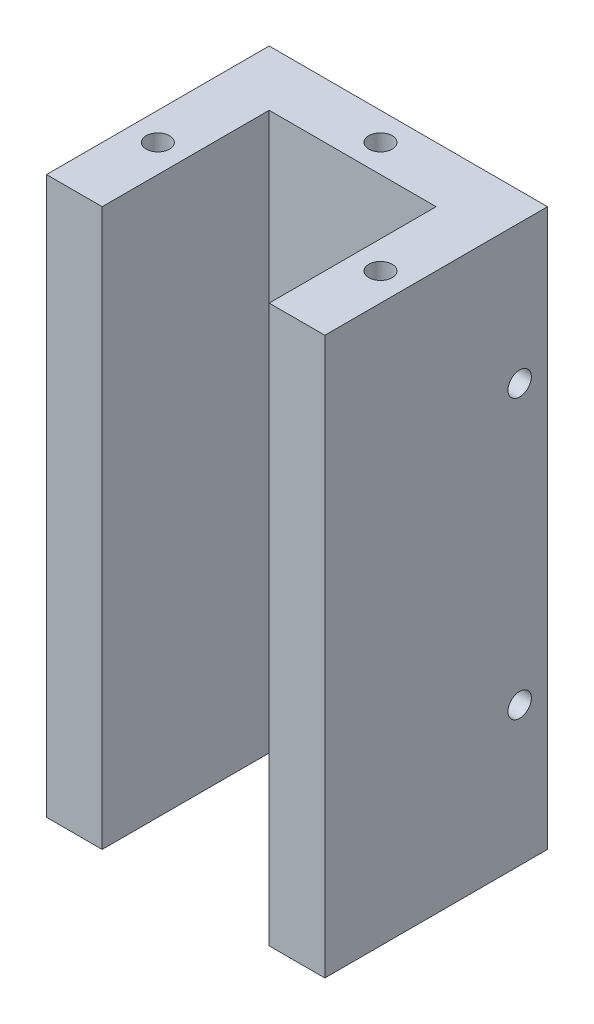
ISO-10303-21;
HEADER;
FILE_DESCRIPTION(('STEP AP214'),'2;1');
FILE_NAME('part.step','',(''),(''),'','','');
FILE_SCHEMA(('AUTOMOTIVE_DESIGN { 1 0 10303 214 1 1 1 1 }'));
ENDSEC;
DATA;
#1=APPLICATION_CONTEXT('core data for automotive mechanical design processes');
#2=APPLICATION_PROTOCOL_DEFINITION('international standard','automotive_design',2000,#1);
#3=PRODUCT_CONTEXT('',#1,'mechanical');
#4=PRODUCT('Part','Part','',(#3));
#5=PRODUCT_RELATED_PRODUCT_CATEGORY('part','',(#4));
#6=PRODUCT_DEFINITION_FORMATION('','',#4);
#7=PRODUCT_DEFINITION_CONTEXT('part definition',#1,'design');
#8=PRODUCT_DEFINITION('design','',#6,#7);
#9=PRODUCT_DEFINITION_SHAPE('','',#8);
#10=(LENGTH_UNIT() NAMED_UNIT(*) SI_UNIT(.MILLI.,.METRE.));
#11=(NAMED_UNIT(*) PLANE_ANGLE_UNIT() SI_UNIT($,.RADIAN.));
#12=(NAMED_UNIT(*) SI_UNIT($,.STERADIAN.) SOLID_ANGLE_UNIT());
#13=UNCERTAINTY_MEASURE_WITH_UNIT(LENGTH_MEASURE(1.E-05),#10,'distance_accuracy_value','');
#14=(GEOMETRIC_REPRESENTATION_CONTEXT(3) GLOBAL_UNCERTAINTY_ASSIGNED_CONTEXT((#13)) GLOBAL_UNIT_ASSIGNED_CONTEXT((#10,
#11,#12)) REPRESENTATION_CONTEXT('',''));
#15=CARTESIAN_POINT('',(0.,0.,0.));
#16=DIRECTION('',(0.,0.,1.));
#17=DIRECTION('',(1.,0.,0.));
#18=AXIS2_PLACEMENT_3D('',#15,#16,#17);
#19=CARTESIAN_POINT('',(-25.,100.,20.));
#20=DIRECTION('',(0.,0.,-1.));
#21=DIRECTION('',(-1.,0.,0.));
#22=AXIS2_PLACEMENT_3D('',#19,#20,#21);
#23=PLANE('',#22);
#24=DIRECTION('',(1.,0.,0.));
#25=VECTOR('',#24,1.);
#26=CARTESIAN_POINT('',(-25.,0.,20.));
#27=LINE('',#26,#25);
#28=CARTESIAN_POINT('',(-25.,0.,20.));
#29=VERTEX_POINT('',#28);
#30=CARTESIAN_POINT('',(-15.,0.,20.));
#31=VERTEX_POINT('',#30);
#32=EDGE_CURVE('E248',#29,#31,#27,.T.);
#33=ORIENTED_EDGE('',*,*,#32,.T.);
#34=DIRECTION('',(0.,1.,0.));
#35=VECTOR('',#34,1.);
#36=CARTESIAN_POINT('',(-15.,0.,20.));
#37=LINE('',#36,#35);
#38=CARTESIAN_POINT('',(-15.,100.,20.));
#39=VERTEX_POINT('',#38);
#40=EDGE_CURVE('E230',#31,#39,#37,.T.);
#41=ORIENTED_EDGE('',*,*,#40,.T.);
#42=DIRECTION('',(1.,0.,0.));
#43=VECTOR('',#42,1.);
#44=CARTESIAN_POINT('',(-25.,100.,20.));
#45=LINE('',#44,#43);
#46=CARTESIAN_POINT('',(-25.,100.,20.));
#47=VERTEX_POINT('',#46);
#48=EDGE_CURVE('E252',#47,#39,#45,.T.);
#49=ORIENTED_EDGE('',*,*,#48,.F.);
#50=DIRECTION('',(0.,-1.,0.));
#51=VECTOR('',#50,1.);
#52=CARTESIAN_POINT('',(-25.,100.,20.));
#53=LINE('',#52,#51);
#54=EDGE_CURVE('E265',#47,#29,#53,.T.);
#55=ORIENTED_EDGE('',*,*,#54,.T.);
#56=EDGE_LOOP('',(#33,#41,#49,#55));
#57=FACE_BOUND('',#56,.T.);
#58=ADVANCED_FACE('F37',(#57),#23,.F.);
#59=CARTESIAN_POINT('',(25.,100.,20.));
#60=DIRECTION('',(-1.,0.,0.));
#61=DIRECTION('',(0.,0.,1.));
#62=AXIS2_PLACEMENT_3D('',#59,#60,#61);
#63=PLANE('',#62);
#64=CARTESIAN_POINT('',(25.,75.,-15.));
#65=DIRECTION('',(1.,0.,0.));
#66=DIRECTION('',(0.,0.,-1.));
#67=AXIS2_PLACEMENT_3D('',#64,#65,#66);
#68=CIRCLE('',#67,2.09999999999999);
#69=CARTESIAN_POINT('',(25.,75.,-17.1));
#70=VERTEX_POINT('',#69);
#71=EDGE_CURVE('E161',#70,#70,#68,.T.);
#72=ORIENTED_EDGE('',*,*,#71,.F.);
#73=EDGE_LOOP('',(#72));
#74=FACE_BOUND('',#73,.T.);
#75=CARTESIAN_POINT('',(25.,25.,-15.));
#76=DIRECTION('',(1.,0.,0.));
#77=DIRECTION('',(0.,0.,-1.));
#78=AXIS2_PLACEMENT_3D('',#75,#76,#77);
#79=CIRCLE('',#78,2.09999999999999);
#80=CARTESIAN_POINT('',(25.,25.,-17.1));
#81=VERTEX_POINT('',#80);
#82=EDGE_CURVE('E167',#81,#81,#79,.T.);
#83=ORIENTED_EDGE('',*,*,#82,.F.);
#84=EDGE_LOOP('',(#83));
#85=FACE_BOUND('',#84,.T.);
#86=DIRECTION('',(0.,0.,-1.));
#87=VECTOR('',#86,1.);
#88=CARTESIAN_POINT('',(25.,0.,20.));
#89=LINE('',#88,#87);
#90=CARTESIAN_POINT('',(25.,0.,20.));
#91=VERTEX_POINT('',#90);
#92=CARTESIAN_POINT('',(25.,0.,-20.));
#93=VERTEX_POINT('',#92);
#94=EDGE_CURVE('E239',#91,#93,#89,.T.);
#95=ORIENTED_EDGE('',*,*,#94,.T.);
#96=DIRECTION('',(0.,-1.,0.));
#97=VECTOR('',#96,1.);
#98=CARTESIAN_POINT('',(25.,100.,-20.));
#99=LINE('',#98,#97);
#100=CARTESIAN_POINT('',(25.,100.,-20.));
#101=VERTEX_POINT('',#100);
#102=EDGE_CURVE('E11',#101,#93,#99,.T.);
#103=ORIENTED_EDGE('',*,*,#102,.F.);
#104=DIRECTION('',(0.,0.,-1.));
#105=VECTOR('',#104,1.);
#106=CARTESIAN_POINT('',(25.,100.,20.));
#107=LINE('',#106,#105);
#108=CARTESIAN_POINT('',(25.,100.,20.));
#109=VERTEX_POINT('',#108);
#110=EDGE_CURVE('E246',#109,#101,#107,.T.);
#111=ORIENTED_EDGE('',*,*,#110,.F.);
#112=DIRECTION('',(0.,-1.,0.));
#113=VECTOR('',#112,1.);
#114=CARTESIAN_POINT('',(25.,100.,20.));
#115=LINE('',#114,#113);
#116=EDGE_CURVE('E255',#109,#91,#115,.T.);
#117=ORIENTED_EDGE('',*,*,#116,.T.);
#118=EDGE_LOOP('',(#95,#103,#111,#117));
#119=FACE_BOUND('',#118,.T.);
#120=ADVANCED_FACE('F39',(#74,#85,#119),#63,.F.);
#121=CARTESIAN_POINT('',(-25.,100.,-20.));
#122=DIRECTION('',(0.,0.,1.));
#123=DIRECTION('',(1.,0.,0.));
#124=AXIS2_PLACEMENT_3D('',#121,#122,#123);
#125=PLANE('',#124);
#126=CARTESIAN_POINT('',(0.,75.,-20.));
#127=DIRECTION('',(0.,0.,-1.));
#128=DIRECTION('',(-1.,0.,0.));
#129=AXIS2_PLACEMENT_3D('',#126,#127,#128);
#130=CIRCLE('',#129,3.5);
#131=CARTESIAN_POINT('',(-3.5,75.,-20.));
#132=VERTEX_POINT('',#131);
#133=EDGE_CURVE('E209',#132,#132,#130,.T.);
#134=ORIENTED_EDGE('',*,*,#133,.F.);
#135=EDGE_LOOP('',(#134));
#136=FACE_BOUND('',#135,.T.);
#137=CARTESIAN_POINT('',(0.,25.,-20.));
#138=DIRECTION('',(0.,0.,-1.));
#139=DIRECTION('',(-1.,0.,0.));
#140=AXIS2_PLACEMENT_3D('',#137,#138,#139);
#141=CIRCLE('',#140,3.5);
#142=CARTESIAN_POINT('',(-3.5,25.,-20.));
#143=VERTEX_POINT('',#142);
#144=EDGE_CURVE('E215',#143,#143,#141,.T.);
#145=ORIENTED_EDGE('',*,*,#144,.F.);
#146=EDGE_LOOP('',(#145));
#147=FACE_BOUND('',#146,.T.);
#148=DIRECTION('',(-1.,0.,0.));
#149=VECTOR('',#148,1.);
#150=CARTESIAN_POINT('',(-25.,0.,-20.));
#151=LINE('',#150,#149);
#152=CARTESIAN_POINT('',(-25.,0.,-20.));
#153=VERTEX_POINT('',#152);
#154=EDGE_CURVE('E258',#93,#153,#151,.T.);
#155=ORIENTED_EDGE('',*,*,#154,.T.);
#156=DIRECTION('',(0.,-1.,0.));
#157=VECTOR('',#156,1.);
#158=CARTESIAN_POINT('',(-25.,100.,-20.));
#159=LINE('',#158,#157);
#160=CARTESIAN_POINT('',(-25.,100.,-20.));
#161=VERTEX_POINT('',#160);
#162=EDGE_CURVE('E45',#161,#153,#159,.T.);
#163=ORIENTED_EDGE('',*,*,#162,.F.);
#164=DIRECTION('',(-1.,0.,0.));
#165=VECTOR('',#164,1.);
#166=CARTESIAN_POINT('',(-25.,100.,-20.));
#167=LINE('',#166,#165);
#168=EDGE_CURVE('E90',#101,#161,#167,.T.);
#169=ORIENTED_EDGE('',*,*,#168,.F.);
#170=ORIENTED_EDGE('',*,*,#102,.T.);
#171=EDGE_LOOP('',(#155,#163,#169,#170));
#172=FACE_BOUND('',#171,.T.);
#173=ADVANCED_FACE('F286',(#136,#147,#172),#125,.F.);
#174=CARTESIAN_POINT('',(-25.,100.,20.));
#175=DIRECTION('',(1.,0.,0.));
#176=DIRECTION('',(0.,0.,-1.));
#177=AXIS2_PLACEMENT_3D('',#174,#175,#176);
#178=PLANE('',#177);
#179=CARTESIAN_POINT('',(-25.,75.,-15.));
#180=DIRECTION('',(-1.,0.,0.));
#181=DIRECTION('',(0.,0.,1.));
#182=AXIS2_PLACEMENT_3D('',#179,#180,#181);
#183=CIRCLE('',#182,2.09999999999999);
#184=CARTESIAN_POINT('',(-25.,75.,-12.9));
#185=VERTEX_POINT('',#184);
#186=EDGE_CURVE('E151',#185,#185,#183,.T.);
#187=ORIENTED_EDGE('',*,*,#186,.F.);
#188=EDGE_LOOP('',(#187));
#189=FACE_BOUND('',#188,.T.);
#190=CARTESIAN_POINT('',(-25.,25.,-15.));
#191=DIRECTION('',(-1.,0.,0.));
#192=DIRECTION('',(0.,0.,1.));
#193=AXIS2_PLACEMENT_3D('',#190,#191,#192);
#194=CIRCLE('',#193,2.09999999999999);
#195=CARTESIAN_POINT('',(-25.,25.,-12.9));
#196=VERTEX_POINT('',#195);
#197=EDGE_CURVE('E150',#196,#196,#194,.T.);
#198=ORIENTED_EDGE('',*,*,#197,.F.);
#199=EDGE_LOOP('',(#198));
#200=FACE_BOUND('',#199,.T.);
#201=DIRECTION('',(0.,0.,1.));
#202=VECTOR('',#201,1.);
#203=CARTESIAN_POINT('',(-25.,0.,20.));
#204=LINE('',#203,#202);
#205=EDGE_CURVE('E260',#153,#29,#204,.T.);
#206=ORIENTED_EDGE('',*,*,#205,.T.);
#207=ORIENTED_EDGE('',*,*,#54,.F.);
#208=DIRECTION('',(0.,0.,1.));
#209=VECTOR('',#208,1.);
#210=CARTESIAN_POINT('',(-25.,100.,20.));
#211=LINE('',#210,#209);
#212=EDGE_CURVE('E250',#161,#47,#211,.T.);
#213=ORIENTED_EDGE('',*,*,#212,.F.);
#214=ORIENTED_EDGE('',*,*,#162,.T.);
#215=EDGE_LOOP('',(#206,#207,#213,#214));
#216=FACE_BOUND('',#215,.T.);
#217=ADVANCED_FACE('F271',(#189,#200,#216),#178,.F.);
#218=CARTESIAN_POINT('',(15.,100.,20.));
#219=VERTEX_POINT('',#218);
#220=EDGE_CURVE('E61',#219,#109,#45,.T.);
#221=ORIENTED_EDGE('',*,*,#220,.F.);
#222=DIRECTION('',(0.,1.,0.));
#223=VECTOR('',#222,1.);
#224=CARTESIAN_POINT('',(15.,0.,20.));
#225=LINE('',#224,#223);
#226=CARTESIAN_POINT('',(15.,0.,20.));
#227=VERTEX_POINT('',#226);
#228=EDGE_CURVE('E242',#227,#219,#225,.T.);
#229=ORIENTED_EDGE('',*,*,#228,.F.);
#230=EDGE_CURVE('E83',#227,#91,#27,.T.);
#231=ORIENTED_EDGE('',*,*,#230,.T.);
#232=ORIENTED_EDGE('',*,*,#116,.F.);
#233=EDGE_LOOP('',(#221,#229,#231,#232));
#234=FACE_BOUND('',#233,.T.);
#235=ADVANCED_FACE('F293',(#234),#23,.F.);
#236=CARTESIAN_POINT('',(25.,100.,-20.));
#237=DIRECTION('',(0.,-1.,0.));
#238=DIRECTION('',(0.,0.,-1.));
#239=AXIS2_PLACEMENT_3D('',#236,#237,#238);
#240=PLANE('',#239);
#241=CARTESIAN_POINT('',(-20.,100.,5.));
#242=DIRECTION('',(0.,1.,0.));
#243=DIRECTION('',(0.,0.,1.));
#244=AXIS2_PLACEMENT_3D('',#241,#242,#243);
#245=CIRCLE('',#244,2.09999999999999);
#246=CARTESIAN_POINT('',(-20.,100.,7.09999999999999));
#247=VERTEX_POINT('',#246);
#248=EDGE_CURVE('E173',#247,#247,#245,.T.);
#249=ORIENTED_EDGE('',*,*,#248,.F.);
#250=EDGE_LOOP('',(#249));
#251=FACE_BOUND('',#250,.T.);
#252=CARTESIAN_POINT('',(20.,100.,5.));
#253=DIRECTION('',(0.,1.,0.));
#254=DIRECTION('',(0.,0.,1.));
#255=AXIS2_PLACEMENT_3D('',#252,#253,#254);
#256=CIRCLE('',#255,2.09999999999999);
#257=CARTESIAN_POINT('',(20.,100.,7.09999999999999));
#258=VERTEX_POINT('',#257);
#259=EDGE_CURVE('E179',#258,#258,#256,.T.);
#260=ORIENTED_EDGE('',*,*,#259,.F.);
#261=EDGE_LOOP('',(#260));
#262=FACE_BOUND('',#261,.T.);
#263=CARTESIAN_POINT('',(0.,100.,-15.));
#264=DIRECTION('',(0.,1.,0.));
#265=DIRECTION('',(0.,0.,1.));
#266=AXIS2_PLACEMENT_3D('',#263,#264,#265);
#267=CIRCLE('',#266,2.09999999999999);
#268=CARTESIAN_POINT('',(0.,100.,-12.9));
#269=VERTEX_POINT('',#268);
#270=EDGE_CURVE('E185',#269,#269,#267,.T.);
#271=ORIENTED_EDGE('',*,*,#270,.F.);
#272=EDGE_LOOP('',(#271));
#273=FACE_BOUND('',#272,.T.);
#274=ORIENTED_EDGE('',*,*,#48,.T.);
#275=DIRECTION('',(0.,0.,1.));
#276=VECTOR('',#275,1.);
#277=CARTESIAN_POINT('',(-15.,100.,20.));
#278=LINE('',#277,#276);
#279=CARTESIAN_POINT('',(-15.,100.,-10.));
#280=VERTEX_POINT('',#279);
#281=EDGE_CURVE('E221',#280,#39,#278,.T.);
#282=ORIENTED_EDGE('',*,*,#281,.F.);
#283=DIRECTION('',(-1.,0.,0.));
#284=VECTOR('',#283,1.);
#285=CARTESIAN_POINT('',(-15.,100.,-10.));
#286=LINE('',#285,#284);
#287=CARTESIAN_POINT('',(15.,100.,-10.));
#288=VERTEX_POINT('',#287);
#289=EDGE_CURVE('E226',#288,#280,#286,.T.);
#290=ORIENTED_EDGE('',*,*,#289,.F.);
#291=DIRECTION('',(0.,0.,-1.));
#292=VECTOR('',#291,1.);
#293=CARTESIAN_POINT('',(15.,100.,20.));
#294=LINE('',#293,#292);
#295=EDGE_CURVE('E232',#219,#288,#294,.T.);
#296=ORIENTED_EDGE('',*,*,#295,.F.);
#297=ORIENTED_EDGE('',*,*,#220,.T.);
#298=ORIENTED_EDGE('',*,*,#110,.T.);
#299=ORIENTED_EDGE('',*,*,#168,.T.);
#300=ORIENTED_EDGE('',*,*,#212,.T.);
#301=EDGE_LOOP('',(#274,#282,#290,#296,#297,#298,#299,#300));
#302=FACE_BOUND('',#301,.T.);
#303=ADVANCED_FACE('F281',(#251,#262,#273,#302),#240,.F.);
#304=CARTESIAN_POINT('',(25.,0.,-20.));
#305=DIRECTION('',(0.,-1.,0.));
#306=DIRECTION('',(0.,0.,-1.));
#307=AXIS2_PLACEMENT_3D('',#304,#305,#306);
#308=PLANE('',#307);
#309=CARTESIAN_POINT('',(0.,0.,-15.));
#310=DIRECTION('',(0.,-1.,0.));
#311=DIRECTION('',(0.,0.,-1.));
#312=AXIS2_PLACEMENT_3D('',#309,#310,#311);
#313=CIRCLE('',#312,2.1);
#314=CARTESIAN_POINT('',(0.,0.,-17.1));
#315=VERTEX_POINT('',#314);
#316=EDGE_CURVE('E191',#315,#315,#313,.T.);
#317=ORIENTED_EDGE('',*,*,#316,.F.);
#318=EDGE_LOOP('',(#317));
#319=FACE_BOUND('',#318,.T.);
#320=CARTESIAN_POINT('',(-20.,0.,5.));
#321=DIRECTION('',(0.,-1.,0.));
#322=DIRECTION('',(0.,0.,-1.));
#323=AXIS2_PLACEMENT_3D('',#320,#321,#322);
#324=CIRCLE('',#323,2.1);
#325=CARTESIAN_POINT('',(-20.,0.,2.9));
#326=VERTEX_POINT('',#325);
#327=EDGE_CURVE('E197',#326,#326,#324,.T.);
#328=ORIENTED_EDGE('',*,*,#327,.F.);
#329=EDGE_LOOP('',(#328));
#330=FACE_BOUND('',#329,.T.);
#331=CARTESIAN_POINT('',(20.,0.,5.));
#332=DIRECTION('',(0.,-1.,0.));
#333=DIRECTION('',(0.,0.,-1.));
#334=AXIS2_PLACEMENT_3D('',#331,#332,#333);
#335=CIRCLE('',#334,2.1);
#336=CARTESIAN_POINT('',(20.,0.,2.9));
#337=VERTEX_POINT('',#336);
#338=EDGE_CURVE('E203',#337,#337,#335,.T.);
#339=ORIENTED_EDGE('',*,*,#338,.F.);
#340=EDGE_LOOP('',(#339));
#341=FACE_BOUND('',#340,.T.);
#342=DIRECTION('',(0.,0.,1.));
#343=VECTOR('',#342,1.);
#344=CARTESIAN_POINT('',(-15.,0.,20.));
#345=LINE('',#344,#343);
#346=CARTESIAN_POINT('',(-15.,0.,-10.));
#347=VERTEX_POINT('',#346);
#348=EDGE_CURVE('E222',#347,#31,#345,.T.);
#349=ORIENTED_EDGE('',*,*,#348,.T.);
#350=ORIENTED_EDGE('',*,*,#32,.F.);
#351=ORIENTED_EDGE('',*,*,#205,.F.);
#352=ORIENTED_EDGE('',*,*,#154,.F.);
#353=ORIENTED_EDGE('',*,*,#94,.F.);
#354=ORIENTED_EDGE('',*,*,#230,.F.);
#355=DIRECTION('',(0.,0.,-1.));
#356=VECTOR('',#355,1.);
#357=CARTESIAN_POINT('',(15.,0.,20.));
#358=LINE('',#357,#356);
#359=CARTESIAN_POINT('',(15.,0.,-10.));
#360=VERTEX_POINT('',#359);
#361=EDGE_CURVE('E225',#227,#360,#358,.T.);
#362=ORIENTED_EDGE('',*,*,#361,.T.);
#363=DIRECTION('',(-1.,0.,0.));
#364=VECTOR('',#363,1.);
#365=CARTESIAN_POINT('',(-15.,0.,-10.));
#366=LINE('',#365,#364);
#367=EDGE_CURVE('E52',#360,#347,#366,.T.);
#368=ORIENTED_EDGE('',*,*,#367,.T.);
#369=EDGE_LOOP('',(#349,#350,#351,#352,#353,#354,#362,#368));
#370=FACE_BOUND('',#369,.T.);
#371=ADVANCED_FACE('F275',(#319,#330,#341,#370),#308,.T.);
#372=CARTESIAN_POINT('',(-15.,0.,20.));
#373=DIRECTION('',(-1.,0.,0.));
#374=DIRECTION('',(0.,0.,1.));
#375=AXIS2_PLACEMENT_3D('',#372,#373,#374);
#376=PLANE('',#375);
#377=ORIENTED_EDGE('',*,*,#281,.T.);
#378=ORIENTED_EDGE('',*,*,#40,.F.);
#379=ORIENTED_EDGE('',*,*,#348,.F.);
#380=DIRECTION('',(0.,1.,0.));
#381=VECTOR('',#380,1.);
#382=CARTESIAN_POINT('',(-15.,0.,-10.));
#383=LINE('',#382,#381);
#384=EDGE_CURVE('E237',#347,#280,#383,.T.);
#385=ORIENTED_EDGE('',*,*,#384,.T.);
#386=EDGE_LOOP('',(#377,#378,#379,#385));
#387=FACE_BOUND('',#386,.T.);
#388=ADVANCED_FACE('F314',(#387),#376,.F.);
#389=CARTESIAN_POINT('',(-15.,0.,-10.));
#390=DIRECTION('',(0.,0.,-1.));
#391=DIRECTION('',(-1.,0.,0.));
#392=AXIS2_PLACEMENT_3D('',#389,#390,#391);
#393=PLANE('',#392);
#394=CARTESIAN_POINT('',(0.,75.,-10.));
#395=DIRECTION('',(0.,0.,-1.));
#396=DIRECTION('',(-1.,0.,0.));
#397=AXIS2_PLACEMENT_3D('',#394,#395,#396);
#398=CIRCLE('',#397,3.5);
#399=CARTESIAN_POINT('',(-3.5,75.,-10.));
#400=VERTEX_POINT('',#399);
#401=EDGE_CURVE('E212',#400,#400,#398,.F.);
#402=ORIENTED_EDGE('',*,*,#401,.F.);
#403=EDGE_LOOP('',(#402));
#404=FACE_BOUND('',#403,.T.);
#405=CARTESIAN_POINT('',(0.,25.,-10.));
#406=DIRECTION('',(0.,0.,-1.));
#407=DIRECTION('',(-1.,0.,0.));
#408=AXIS2_PLACEMENT_3D('',#405,#406,#407);
#409=CIRCLE('',#408,3.5);
#410=CARTESIAN_POINT('',(-3.5,25.,-10.));
#411=VERTEX_POINT('',#410);
#412=EDGE_CURVE('E218',#411,#411,#409,.F.);
#413=ORIENTED_EDGE('',*,*,#412,.F.);
#414=EDGE_LOOP('',(#413));
#415=FACE_BOUND('',#414,.T.);
#416=ORIENTED_EDGE('',*,*,#289,.T.);
#417=ORIENTED_EDGE('',*,*,#384,.F.);
#418=ORIENTED_EDGE('',*,*,#367,.F.);
#419=DIRECTION('',(0.,1.,0.));
#420=VECTOR('',#419,1.);
#421=CARTESIAN_POINT('',(15.,0.,-10.));
#422=LINE('',#421,#420);
#423=EDGE_CURVE('E240',#360,#288,#422,.T.);
#424=ORIENTED_EDGE('',*,*,#423,.T.);
#425=EDGE_LOOP('',(#416,#417,#418,#424));
#426=FACE_BOUND('',#425,.T.);
#427=ADVANCED_FACE('F312',(#404,#415,#426),#393,.F.);
#428=CARTESIAN_POINT('',(15.,0.,20.));
#429=DIRECTION('',(1.,0.,0.));
#430=DIRECTION('',(0.,0.,-1.));
#431=AXIS2_PLACEMENT_3D('',#428,#429,#430);
#432=PLANE('',#431);
#433=ORIENTED_EDGE('',*,*,#295,.T.);
#434=ORIENTED_EDGE('',*,*,#423,.F.);
#435=ORIENTED_EDGE('',*,*,#361,.F.);
#436=ORIENTED_EDGE('',*,*,#228,.T.);
#437=EDGE_LOOP('',(#433,#434,#435,#436));
#438=FACE_BOUND('',#437,.T.);
#439=ADVANCED_FACE('F311',(#438),#432,.F.);
#440=CARTESIAN_POINT('',(0.,25.,-0.100505063388327));
#441=DIRECTION('',(0.,0.,-1.));
#442=DIRECTION('',(-1.,0.,0.));
#443=AXIS2_PLACEMENT_3D('',#440,#441,#442);
#444=CYLINDRICAL_SURFACE('',#443,3.5);
#445=ORIENTED_EDGE('',*,*,#412,.T.);
#446=EDGE_LOOP('',(#445));
#447=FACE_BOUND('',#446,.T.);
#448=ORIENTED_EDGE('',*,*,#144,.T.);
#449=EDGE_LOOP('',(#448));
#450=FACE_BOUND('',#449,.T.);
#451=ADVANCED_FACE('F326',(#447,#450),#444,.F.);
#452=CARTESIAN_POINT('',(0.,75.,-0.100505063388327));
#453=DIRECTION('',(0.,0.,-1.));
#454=DIRECTION('',(-1.,0.,0.));
#455=AXIS2_PLACEMENT_3D('',#452,#453,#454);
#456=CYLINDRICAL_SURFACE('',#455,3.5);
#457=ORIENTED_EDGE('',*,*,#401,.T.);
#458=EDGE_LOOP('',(#457));
#459=FACE_BOUND('',#458,.T.);
#460=ORIENTED_EDGE('',*,*,#133,.T.);
#461=EDGE_LOOP('',(#460));
#462=FACE_BOUND('',#461,.T.);
#463=ADVANCED_FACE('F330',(#459,#462),#456,.F.);
#464=CARTESIAN_POINT('',(20.,14.,5.));
#465=DIRECTION('',(0.,-1.,0.));
#466=DIRECTION('',(0.,0.,-1.));
#467=AXIS2_PLACEMENT_3D('',#464,#465,#466);
#468=CONICAL_SURFACE('',#467,2.1,1.02974425867665);
#469=CARTESIAN_POINT('',(20.,15.2618072999579,5.));
#470=VERTEX_POINT('',#469);
#471=VERTEX_LOOP('',#470);
#472=FACE_BOUND('',#471,.T.);
#473=CARTESIAN_POINT('',(20.,14.,5.));
#474=DIRECTION('',(0.,-1.,0.));
#475=DIRECTION('',(0.,0.,-1.));
#476=AXIS2_PLACEMENT_3D('',#473,#474,#475);
#477=CIRCLE('',#476,2.1);
#478=CARTESIAN_POINT('',(20.,14.,2.9));
#479=VERTEX_POINT('',#478);
#480=EDGE_CURVE('E206',#479,#479,#477,.T.);
#481=ORIENTED_EDGE('',*,*,#480,.T.);
#482=EDGE_LOOP('',(#481));
#483=FACE_BOUND('',#482,.T.);
#484=ADVANCED_FACE('F334',(#472,#483),#468,.F.);
#485=CARTESIAN_POINT('',(20.,0.,5.));
#486=DIRECTION('',(0.,-1.,0.));
#487=DIRECTION('',(0.,0.,-1.));
#488=AXIS2_PLACEMENT_3D('',#485,#486,#487);
#489=CYLINDRICAL_SURFACE('',#488,2.1);
#490=ORIENTED_EDGE('',*,*,#480,.F.);
#491=EDGE_LOOP('',(#490));
#492=FACE_BOUND('',#491,.T.);
#493=ORIENTED_EDGE('',*,*,#338,.T.);
#494=EDGE_LOOP('',(#493));
#495=FACE_BOUND('',#494,.T.);
#496=ADVANCED_FACE('F338',(#492,#495),#489,.F.);
#497=CARTESIAN_POINT('',(-20.,14.,5.));
#498=DIRECTION('',(0.,-1.,0.));
#499=DIRECTION('',(0.,0.,-1.));
#500=AXIS2_PLACEMENT_3D('',#497,#498,#499);
#501=CONICAL_SURFACE('',#500,2.1,1.02974425867665);
#502=CARTESIAN_POINT('',(-20.,15.2618072999579,5.));
#503=VERTEX_POINT('',#502);
#504=VERTEX_LOOP('',#503);
#505=FACE_BOUND('',#504,.T.);
#506=CARTESIAN_POINT('',(-20.,14.,5.));
#507=DIRECTION('',(0.,-1.,0.));
#508=DIRECTION('',(0.,0.,-1.));
#509=AXIS2_PLACEMENT_3D('',#506,#507,#508);
#510=CIRCLE('',#509,2.1);
#511=CARTESIAN_POINT('',(-20.,14.,2.9));
#512=VERTEX_POINT('',#511);
#513=EDGE_CURVE('E200',#512,#512,#510,.T.);
#514=ORIENTED_EDGE('',*,*,#513,.T.);
#515=EDGE_LOOP('',(#514));
#516=FACE_BOUND('',#515,.T.);
#517=ADVANCED_FACE('F342',(#505,#516),#501,.F.);
#518=CARTESIAN_POINT('',(-20.,0.,5.));
#519=DIRECTION('',(0.,-1.,0.));
#520=DIRECTION('',(0.,0.,-1.));
#521=AXIS2_PLACEMENT_3D('',#518,#519,#520);
#522=CYLINDRICAL_SURFACE('',#521,2.1);
#523=ORIENTED_EDGE('',*,*,#513,.F.);
#524=EDGE_LOOP('',(#523));
#525=FACE_BOUND('',#524,.T.);
#526=ORIENTED_EDGE('',*,*,#327,.T.);
#527=EDGE_LOOP('',(#526));
#528=FACE_BOUND('',#527,.T.);
#529=ADVANCED_FACE('F346',(#525,#528),#522,.F.);
#530=CARTESIAN_POINT('',(0.,14.,-15.));
#531=DIRECTION('',(0.,-1.,0.));
#532=DIRECTION('',(0.,0.,-1.));
#533=AXIS2_PLACEMENT_3D('',#530,#531,#532);
#534=CONICAL_SURFACE('',#533,2.1,1.02974425867665);
#535=CARTESIAN_POINT('',(0.,15.2618072999579,-15.));
#536=VERTEX_POINT('',#535);
#537=VERTEX_LOOP('',#536);
#538=FACE_BOUND('',#537,.T.);
#539=CARTESIAN_POINT('',(0.,14.,-15.));
#540=DIRECTION('',(0.,-1.,0.));
#541=DIRECTION('',(0.,0.,-1.));
#542=AXIS2_PLACEMENT_3D('',#539,#540,#541);
#543=CIRCLE('',#542,2.1);
#544=CARTESIAN_POINT('',(0.,14.,-17.1));
#545=VERTEX_POINT('',#544);
#546=EDGE_CURVE('E194',#545,#545,#543,.T.);
#547=ORIENTED_EDGE('',*,*,#546,.T.);
#548=EDGE_LOOP('',(#547));
#549=FACE_BOUND('',#548,.T.);
#550=ADVANCED_FACE('F350',(#538,#549),#534,.F.);
#551=CARTESIAN_POINT('',(0.,0.,-15.));
#552=DIRECTION('',(0.,-1.,0.));
#553=DIRECTION('',(0.,0.,-1.));
#554=AXIS2_PLACEMENT_3D('',#551,#552,#553);
#555=CYLINDRICAL_SURFACE('',#554,2.1);
#556=ORIENTED_EDGE('',*,*,#546,.F.);
#557=EDGE_LOOP('',(#556));
#558=FACE_BOUND('',#557,.T.);
#559=ORIENTED_EDGE('',*,*,#316,.T.);
#560=EDGE_LOOP('',(#559));
#561=FACE_BOUND('',#560,.T.);
#562=ADVANCED_FACE('F354',(#558,#561),#555,.F.);
#563=CARTESIAN_POINT('',(0.,86.,-15.));
#564=DIRECTION('',(0.,1.,0.));
#565=DIRECTION('',(0.,0.,1.));
#566=AXIS2_PLACEMENT_3D('',#563,#564,#565);
#567=CONICAL_SURFACE('',#566,2.09999999999999,1.02974425867665);
#568=CARTESIAN_POINT('',(0.,84.7381927000421,-15.));
#569=VERTEX_POINT('',#568);
#570=VERTEX_LOOP('',#569);
#571=FACE_BOUND('',#570,.T.);
#572=CARTESIAN_POINT('',(0.,86.,-15.));
#573=DIRECTION('',(0.,1.,0.));
#574=DIRECTION('',(0.,0.,1.));
#575=AXIS2_PLACEMENT_3D('',#572,#573,#574);
#576=CIRCLE('',#575,2.09999999999999);
#577=CARTESIAN_POINT('',(0.,86.,-12.9));
#578=VERTEX_POINT('',#577);
#579=EDGE_CURVE('E188',#578,#578,#576,.T.);
#580=ORIENTED_EDGE('',*,*,#579,.T.);
#581=EDGE_LOOP('',(#580));
#582=FACE_BOUND('',#581,.T.);
#583=ADVANCED_FACE('F358',(#571,#582),#567,.F.);
#584=CARTESIAN_POINT('',(0.,100.,-15.));
#585=DIRECTION('',(0.,1.,0.));
#586=DIRECTION('',(0.,0.,1.));
#587=AXIS2_PLACEMENT_3D('',#584,#585,#586);
#588=CYLINDRICAL_SURFACE('',#587,2.09999999999999);
#589=ORIENTED_EDGE('',*,*,#579,.F.);
#590=EDGE_LOOP('',(#589));
#591=FACE_BOUND('',#590,.T.);
#592=ORIENTED_EDGE('',*,*,#270,.T.);
#593=EDGE_LOOP('',(#592));
#594=FACE_BOUND('',#593,.T.);
#595=ADVANCED_FACE('F362',(#591,#594),#588,.F.);
#596=CARTESIAN_POINT('',(20.,86.,5.));
#597=DIRECTION('',(0.,1.,0.));
#598=DIRECTION('',(0.,0.,1.));
#599=AXIS2_PLACEMENT_3D('',#596,#597,#598);
#600=CONICAL_SURFACE('',#599,2.09999999999999,1.02974425867665);
#601=CARTESIAN_POINT('',(20.,84.7381927000421,5.));
#602=VERTEX_POINT('',#601);
#603=VERTEX_LOOP('',#602);
#604=FACE_BOUND('',#603,.T.);
#605=CARTESIAN_POINT('',(20.,86.,5.));
#606=DIRECTION('',(0.,1.,0.));
#607=DIRECTION('',(0.,0.,1.));
#608=AXIS2_PLACEMENT_3D('',#605,#606,#607);
#609=CIRCLE('',#608,2.09999999999999);
#610=CARTESIAN_POINT('',(20.,86.,7.09999999999999));
#611=VERTEX_POINT('',#610);
#612=EDGE_CURVE('E182',#611,#611,#609,.T.);
#613=ORIENTED_EDGE('',*,*,#612,.T.);
#614=EDGE_LOOP('',(#613));
#615=FACE_BOUND('',#614,.T.);
#616=ADVANCED_FACE('F366',(#604,#615),#600,.F.);
#617=CARTESIAN_POINT('',(20.,100.,5.));
#618=DIRECTION('',(0.,1.,0.));
#619=DIRECTION('',(0.,0.,1.));
#620=AXIS2_PLACEMENT_3D('',#617,#618,#619);
#621=CYLINDRICAL_SURFACE('',#620,2.09999999999999);
#622=ORIENTED_EDGE('',*,*,#612,.F.);
#623=EDGE_LOOP('',(#622));
#624=FACE_BOUND('',#623,.T.);
#625=ORIENTED_EDGE('',*,*,#259,.T.);
#626=EDGE_LOOP('',(#625));
#627=FACE_BOUND('',#626,.T.);
#628=ADVANCED_FACE('F370',(#624,#627),#621,.F.);
#629=CARTESIAN_POINT('',(-20.,86.,5.));
#630=DIRECTION('',(0.,1.,0.));
#631=DIRECTION('',(0.,0.,1.));
#632=AXIS2_PLACEMENT_3D('',#629,#630,#631);
#633=CONICAL_SURFACE('',#632,2.09999999999999,1.02974425867665);
#634=CARTESIAN_POINT('',(-20.,84.7381927000421,5.));
#635=VERTEX_POINT('',#634);
#636=VERTEX_LOOP('',#635);
#637=FACE_BOUND('',#636,.T.);
#638=CARTESIAN_POINT('',(-20.,86.,5.));
#639=DIRECTION('',(0.,1.,0.));
#640=DIRECTION('',(0.,0.,1.));
#641=AXIS2_PLACEMENT_3D('',#638,#639,#640);
#642=CIRCLE('',#641,2.09999999999999);
#643=CARTESIAN_POINT('',(-20.,86.,7.09999999999999));
#644=VERTEX_POINT('',#643);
#645=EDGE_CURVE('E176',#644,#644,#642,.T.);
#646=ORIENTED_EDGE('',*,*,#645,.T.);
#647=EDGE_LOOP('',(#646));
#648=FACE_BOUND('',#647,.T.);
#649=ADVANCED_FACE('F374',(#637,#648),#633,.F.);
#650=CARTESIAN_POINT('',(-20.,100.,5.));
#651=DIRECTION('',(0.,1.,0.));
#652=DIRECTION('',(0.,0.,1.));
#653=AXIS2_PLACEMENT_3D('',#650,#651,#652);
#654=CYLINDRICAL_SURFACE('',#653,2.09999999999999);
#655=ORIENTED_EDGE('',*,*,#645,.F.);
#656=EDGE_LOOP('',(#655));
#657=FACE_BOUND('',#656,.T.);
#658=ORIENTED_EDGE('',*,*,#248,.T.);
#659=EDGE_LOOP('',(#658));
#660=FACE_BOUND('',#659,.T.);
#661=ADVANCED_FACE('F378',(#657,#660),#654,.F.);
#662=CARTESIAN_POINT('',(11.,25.,-15.));
#663=DIRECTION('',(1.,0.,0.));
#664=DIRECTION('',(0.,0.,-1.));
#665=AXIS2_PLACEMENT_3D('',#662,#663,#664);
#666=CONICAL_SURFACE('',#665,2.09999999999999,1.02974425867665);
#667=CARTESIAN_POINT('',(9.73819270004213,25.,-15.));
#668=VERTEX_POINT('',#667);
#669=VERTEX_LOOP('',#668);
#670=FACE_BOUND('',#669,.T.);
#671=CARTESIAN_POINT('',(11.,25.,-15.));
#672=DIRECTION('',(1.,0.,0.));
#673=DIRECTION('',(0.,0.,-1.));
#674=AXIS2_PLACEMENT_3D('',#671,#672,#673);
#675=CIRCLE('',#674,2.09999999999999);
#676=CARTESIAN_POINT('',(11.,25.,-17.1));
#677=VERTEX_POINT('',#676);
#678=EDGE_CURVE('E170',#677,#677,#675,.T.);
#679=ORIENTED_EDGE('',*,*,#678,.T.);
#680=EDGE_LOOP('',(#679));
#681=FACE_BOUND('',#680,.T.);
#682=ADVANCED_FACE('F382',(#670,#681),#666,.F.);
#683=CARTESIAN_POINT('',(25.,25.,-15.));
#684=DIRECTION('',(1.,0.,0.));
#685=DIRECTION('',(0.,0.,-1.));
#686=AXIS2_PLACEMENT_3D('',#683,#684,#685);
#687=CYLINDRICAL_SURFACE('',#686,2.09999999999999);
#688=ORIENTED_EDGE('',*,*,#678,.F.);
#689=EDGE_LOOP('',(#688));
#690=FACE_BOUND('',#689,.T.);
#691=ORIENTED_EDGE('',*,*,#82,.T.);
#692=EDGE_LOOP('',(#691));
#693=FACE_BOUND('',#692,.T.);
#694=ADVANCED_FACE('F386',(#690,#693),#687,.F.);
#695=CARTESIAN_POINT('',(11.,75.,-15.));
#696=DIRECTION('',(1.,0.,0.));
#697=DIRECTION('',(0.,0.,-1.));
#698=AXIS2_PLACEMENT_3D('',#695,#696,#697);
#699=CONICAL_SURFACE('',#698,2.09999999999999,1.02974425867666);
#700=CARTESIAN_POINT('',(9.73819270004213,75.,-15.));
#701=VERTEX_POINT('',#700);
#702=VERTEX_LOOP('',#701);
#703=FACE_BOUND('',#702,.T.);
#704=CARTESIAN_POINT('',(11.,75.,-15.));
#705=DIRECTION('',(1.,0.,0.));
#706=DIRECTION('',(0.,0.,-1.));
#707=AXIS2_PLACEMENT_3D('',#704,#705,#706);
#708=CIRCLE('',#707,2.09999999999999);
#709=CARTESIAN_POINT('',(11.,75.,-17.1));
#710=VERTEX_POINT('',#709);
#711=EDGE_CURVE('E164',#710,#710,#708,.T.);
#712=ORIENTED_EDGE('',*,*,#711,.T.);
#713=EDGE_LOOP('',(#712));
#714=FACE_BOUND('',#713,.T.);
#715=ADVANCED_FACE('F390',(#703,#714),#699,.F.);
#716=CARTESIAN_POINT('',(25.,75.,-15.));
#717=DIRECTION('',(1.,0.,0.));
#718=DIRECTION('',(0.,0.,-1.));
#719=AXIS2_PLACEMENT_3D('',#716,#717,#718);
#720=CYLINDRICAL_SURFACE('',#719,2.09999999999999);
#721=ORIENTED_EDGE('',*,*,#711,.F.);
#722=EDGE_LOOP('',(#721));
#723=FACE_BOUND('',#722,.T.);
#724=ORIENTED_EDGE('',*,*,#71,.T.);
#725=EDGE_LOOP('',(#724));
#726=FACE_BOUND('',#725,.T.);
#727=ADVANCED_FACE('F394',(#723,#726),#720,.F.);
#728=CARTESIAN_POINT('',(-11.,25.,-15.));
#729=DIRECTION('',(-1.,0.,0.));
#730=DIRECTION('',(0.,0.,1.));
#731=AXIS2_PLACEMENT_3D('',#728,#729,#730);
#732=CONICAL_SURFACE('',#731,2.09999999999999,1.02974425867665);
#733=CARTESIAN_POINT('',(-9.73819270004213,25.,-15.));
#734=VERTEX_POINT('',#733);
#735=VERTEX_LOOP('',#734);
#736=FACE_BOUND('',#735,.T.);
#737=CARTESIAN_POINT('',(-11.,25.,-15.));
#738=DIRECTION('',(-1.,0.,0.));
#739=DIRECTION('',(0.,0.,1.));
#740=AXIS2_PLACEMENT_3D('',#737,#738,#739);
#741=CIRCLE('',#740,2.09999999999999);
#742=CARTESIAN_POINT('',(-11.,25.,-12.9));
#743=VERTEX_POINT('',#742);
#744=EDGE_CURVE('E154',#743,#743,#741,.T.);
#745=ORIENTED_EDGE('',*,*,#744,.T.);
#746=EDGE_LOOP('',(#745));
#747=FACE_BOUND('',#746,.T.);
#748=ADVANCED_FACE('F398',(#736,#747),#732,.F.);
#749=CARTESIAN_POINT('',(-25.,25.,-15.));
#750=DIRECTION('',(-1.,0.,0.));
#751=DIRECTION('',(0.,0.,1.));
#752=AXIS2_PLACEMENT_3D('',#749,#750,#751);
#753=CYLINDRICAL_SURFACE('',#752,2.09999999999999);
#754=ORIENTED_EDGE('',*,*,#744,.F.);
#755=EDGE_LOOP('',(#754));
#756=FACE_BOUND('',#755,.T.);
#757=ORIENTED_EDGE('',*,*,#197,.T.);
#758=EDGE_LOOP('',(#757));
#759=FACE_BOUND('',#758,.T.);
#760=ADVANCED_FACE('F144',(#756,#759),#753,.F.);
#761=CARTESIAN_POINT('',(-11.,75.,-15.));
#762=DIRECTION('',(-1.,0.,0.));
#763=DIRECTION('',(0.,0.,1.));
#764=AXIS2_PLACEMENT_3D('',#761,#762,#763);
#765=CONICAL_SURFACE('',#764,2.09999999999999,1.02974425867666);
#766=CARTESIAN_POINT('',(-9.73819270004213,75.,-15.));
#767=VERTEX_POINT('',#766);
#768=VERTEX_LOOP('',#767);
#769=FACE_BOUND('',#768,.T.);
#770=CARTESIAN_POINT('',(-11.,75.,-15.));
#771=DIRECTION('',(-1.,0.,0.));
#772=DIRECTION('',(0.,0.,1.));
#773=AXIS2_PLACEMENT_3D('',#770,#771,#772);
#774=CIRCLE('',#773,2.09999999999999);
#775=CARTESIAN_POINT('',(-11.,75.,-12.9));
#776=VERTEX_POINT('',#775);
#777=EDGE_CURVE('E148',#776,#776,#774,.T.);
#778=ORIENTED_EDGE('',*,*,#777,.T.);
#779=EDGE_LOOP('',(#778));
#780=FACE_BOUND('',#779,.T.);
#781=ADVANCED_FACE('F140',(#769,#780),#765,.F.);
#782=CARTESIAN_POINT('',(-25.,75.,-15.));
#783=DIRECTION('',(-1.,0.,0.));
#784=DIRECTION('',(0.,0.,1.));
#785=AXIS2_PLACEMENT_3D('',#782,#783,#784);
#786=CYLINDRICAL_SURFACE('',#785,2.09999999999999);
#787=ORIENTED_EDGE('',*,*,#777,.F.);
#788=EDGE_LOOP('',(#787));
#789=FACE_BOUND('',#788,.T.);
#790=ORIENTED_EDGE('',*,*,#186,.T.);
#791=EDGE_LOOP('',(#790));
#792=FACE_BOUND('',#791,.T.);
#793=ADVANCED_FACE('F143',(#789,#792),#786,.F.);
#794=CLOSED_SHELL('',(#58,#120,#173,#217,#235,#303,#371,#388,#427,#439,#451,#463,#484,#496,#517,
#529,#550,#562,#583,#595,#616,#628,#649,#661,#682,#694,#715,#727,#748,#760,#781,#793));
#795=MANIFOLD_SOLID_BREP('B2',#794);
#796=ADVANCED_BREP_SHAPE_REPRESENTATION('',(#18,#795),#14);
#797=SHAPE_DEFINITION_REPRESENTATION(#9,#796);
ENDSEC;
END-ISO-10303-21;
